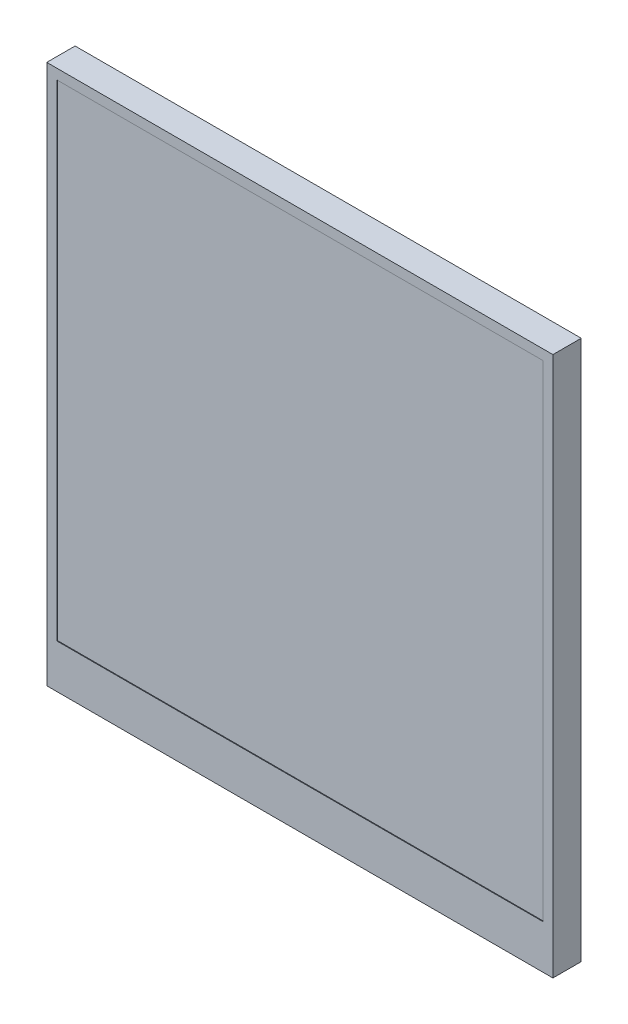
ISO-10303-21;
HEADER;
FILE_DESCRIPTION(('STEP AP214'),'2;1');
FILE_NAME('part.step','',(''),(''),'','','');
FILE_SCHEMA(('AUTOMOTIVE_DESIGN { 1 0 10303 214 1 1 1 1 }'));
ENDSEC;
DATA;
#1=APPLICATION_CONTEXT('core data for automotive mechanical design processes');
#2=APPLICATION_PROTOCOL_DEFINITION('international standard','automotive_design',2000,#1);
#3=PRODUCT_CONTEXT('',#1,'mechanical');
#4=PRODUCT('Part','Part','',(#3));
#5=PRODUCT_RELATED_PRODUCT_CATEGORY('part','',(#4));
#6=PRODUCT_DEFINITION_FORMATION('','',#4);
#7=PRODUCT_DEFINITION_CONTEXT('part definition',#1,'design');
#8=PRODUCT_DEFINITION('design','',#6,#7);
#9=PRODUCT_DEFINITION_SHAPE('','',#8);
#10=(LENGTH_UNIT() NAMED_UNIT(*) SI_UNIT(.MILLI.,.METRE.));
#11=(NAMED_UNIT(*) PLANE_ANGLE_UNIT() SI_UNIT($,.RADIAN.));
#12=(NAMED_UNIT(*) SI_UNIT($,.STERADIAN.) SOLID_ANGLE_UNIT());
#13=UNCERTAINTY_MEASURE_WITH_UNIT(LENGTH_MEASURE(1.E-05),#10,'distance_accuracy_value','');
#14=(GEOMETRIC_REPRESENTATION_CONTEXT(3) GLOBAL_UNCERTAINTY_ASSIGNED_CONTEXT((#13)) GLOBAL_UNIT_ASSIGNED_CONTEXT((#10,
#11,#12)) REPRESENTATION_CONTEXT('',''));
#15=CARTESIAN_POINT('',(0.,0.,0.));
#16=DIRECTION('',(0.,0.,1.));
#17=DIRECTION('',(1.,0.,0.));
#18=AXIS2_PLACEMENT_3D('',#15,#16,#17);
#19=CARTESIAN_POINT('',(0.,0.,4.2));
#20=DIRECTION('',(1.,0.,0.));
#21=DIRECTION('',(0.,0.,-1.));
#22=AXIS2_PLACEMENT_3D('',#19,#20,#21);
#23=PLANE('',#22);
#24=DIRECTION('',(0.,-1.,0.));
#25=VECTOR('',#24,1.);
#26=CARTESIAN_POINT('',(0.,0.,0.));
#27=LINE('',#26,#25);
#28=CARTESIAN_POINT('',(0.,80.,0.));
#29=VERTEX_POINT('',#28);
#30=CARTESIAN_POINT('',(0.,0.,0.));
#31=VERTEX_POINT('',#30);
#32=EDGE_CURVE('E148',#29,#31,#27,.T.);
#33=ORIENTED_EDGE('',*,*,#32,.T.);
#34=DIRECTION('',(0.,0.,-1.));
#35=VECTOR('',#34,1.);
#36=CARTESIAN_POINT('',(0.,0.,4.2));
#37=LINE('',#36,#35);
#38=CARTESIAN_POINT('',(0.,0.,4.2));
#39=VERTEX_POINT('',#38);
#40=EDGE_CURVE('E172',#39,#31,#37,.T.);
#41=ORIENTED_EDGE('',*,*,#40,.F.);
#42=DIRECTION('',(0.,-1.,0.));
#43=VECTOR('',#42,1.);
#44=CARTESIAN_POINT('',(0.,0.,4.2));
#45=LINE('',#44,#43);
#46=CARTESIAN_POINT('',(0.,80.,4.2));
#47=VERTEX_POINT('',#46);
#48=EDGE_CURVE('E152',#47,#39,#45,.T.);
#49=ORIENTED_EDGE('',*,*,#48,.F.);
#50=DIRECTION('',(0.,0.,-1.));
#51=VECTOR('',#50,1.);
#52=CARTESIAN_POINT('',(0.,80.,4.2));
#53=LINE('',#52,#51);
#54=EDGE_CURVE('E158',#47,#29,#53,.T.);
#55=ORIENTED_EDGE('',*,*,#54,.T.);
#56=EDGE_LOOP('',(#33,#41,#49,#55));
#57=FACE_BOUND('',#56,.T.);
#58=ADVANCED_FACE('F35',(#57),#23,.F.);
#59=CARTESIAN_POINT('',(0.,0.,4.2));
#60=DIRECTION('',(0.,1.,0.));
#61=DIRECTION('',(0.,0.,1.));
#62=AXIS2_PLACEMENT_3D('',#59,#60,#61);
#63=PLANE('',#62);
#64=DIRECTION('',(1.,0.,0.));
#65=VECTOR('',#64,1.);
#66=CARTESIAN_POINT('',(0.,0.,0.));
#67=LINE('',#66,#65);
#68=CARTESIAN_POINT('',(75.,0.,0.));
#69=VERTEX_POINT('',#68);
#70=EDGE_CURVE('E161',#31,#69,#67,.T.);
#71=ORIENTED_EDGE('',*,*,#70,.T.);
#72=DIRECTION('',(0.,0.,-1.));
#73=VECTOR('',#72,1.);
#74=CARTESIAN_POINT('',(75.,0.,4.2));
#75=LINE('',#74,#73);
#76=CARTESIAN_POINT('',(75.,0.,4.2));
#77=VERTEX_POINT('',#76);
#78=EDGE_CURVE('E169',#77,#69,#75,.T.);
#79=ORIENTED_EDGE('',*,*,#78,.F.);
#80=DIRECTION('',(1.,0.,0.));
#81=VECTOR('',#80,1.);
#82=CARTESIAN_POINT('',(0.,0.,4.2));
#83=LINE('',#82,#81);
#84=EDGE_CURVE('E87',#39,#77,#83,.T.);
#85=ORIENTED_EDGE('',*,*,#84,.F.);
#86=ORIENTED_EDGE('',*,*,#40,.T.);
#87=EDGE_LOOP('',(#71,#79,#85,#86));
#88=FACE_BOUND('',#87,.T.);
#89=ADVANCED_FACE('F212',(#88),#63,.F.);
#90=CARTESIAN_POINT('',(75.,0.,4.2));
#91=DIRECTION('',(-1.,0.,0.));
#92=DIRECTION('',(0.,0.,1.));
#93=AXIS2_PLACEMENT_3D('',#90,#91,#92);
#94=PLANE('',#93);
#95=DIRECTION('',(0.,1.,0.));
#96=VECTOR('',#95,1.);
#97=CARTESIAN_POINT('',(75.,0.,0.));
#98=LINE('',#97,#96);
#99=CARTESIAN_POINT('',(75.,80.,0.));
#100=VERTEX_POINT('',#99);
#101=EDGE_CURVE('E163',#69,#100,#98,.T.);
#102=ORIENTED_EDGE('',*,*,#101,.T.);
#103=DIRECTION('',(0.,0.,-1.));
#104=VECTOR('',#103,1.);
#105=CARTESIAN_POINT('',(75.,80.,4.2));
#106=LINE('',#105,#104);
#107=CARTESIAN_POINT('',(75.,80.,4.2));
#108=VERTEX_POINT('',#107);
#109=EDGE_CURVE('E167',#108,#100,#106,.T.);
#110=ORIENTED_EDGE('',*,*,#109,.F.);
#111=DIRECTION('',(0.,1.,0.));
#112=VECTOR('',#111,1.);
#113=CARTESIAN_POINT('',(75.,0.,4.2));
#114=LINE('',#113,#112);
#115=EDGE_CURVE('E155',#77,#108,#114,.T.);
#116=ORIENTED_EDGE('',*,*,#115,.F.);
#117=ORIENTED_EDGE('',*,*,#78,.T.);
#118=EDGE_LOOP('',(#102,#110,#116,#117));
#119=FACE_BOUND('',#118,.T.);
#120=ADVANCED_FACE('F217',(#119),#94,.F.);
#121=CARTESIAN_POINT('',(0.,80.,4.2));
#122=DIRECTION('',(0.,-1.,0.));
#123=DIRECTION('',(0.,0.,-1.));
#124=AXIS2_PLACEMENT_3D('',#121,#122,#123);
#125=PLANE('',#124);
#126=DIRECTION('',(-1.,0.,0.));
#127=VECTOR('',#126,1.);
#128=CARTESIAN_POINT('',(0.,80.,0.));
#129=LINE('',#128,#127);
#130=EDGE_CURVE('E79',#100,#29,#129,.T.);
#131=ORIENTED_EDGE('',*,*,#130,.T.);
#132=ORIENTED_EDGE('',*,*,#54,.F.);
#133=DIRECTION('',(-1.,0.,0.));
#134=VECTOR('',#133,1.);
#135=CARTESIAN_POINT('',(0.,80.,4.2));
#136=LINE('',#135,#134);
#137=EDGE_CURVE('E58',#108,#47,#136,.T.);
#138=ORIENTED_EDGE('',*,*,#137,.F.);
#139=ORIENTED_EDGE('',*,*,#109,.T.);
#140=EDGE_LOOP('',(#131,#132,#138,#139));
#141=FACE_BOUND('',#140,.T.);
#142=ADVANCED_FACE('F228',(#141),#125,.F.);
#143=CARTESIAN_POINT('',(0.,0.,4.2));
#144=DIRECTION('',(0.,0.,-1.));
#145=DIRECTION('',(-1.,0.,0.));
#146=AXIS2_PLACEMENT_3D('',#143,#144,#145);
#147=PLANE('',#146);
#148=DIRECTION('',(1.,0.,0.));
#149=VECTOR('',#148,1.);
#150=CARTESIAN_POINT('',(1.50000000000001,6.50000000000001,4.2));
#151=LINE('',#150,#149);
#152=CARTESIAN_POINT('',(1.50000000000001,6.50000000000001,4.2));
#153=VERTEX_POINT('',#152);
#154=CARTESIAN_POINT('',(73.5,6.50000000000001,4.2));
#155=VERTEX_POINT('',#154);
#156=EDGE_CURVE('E141',#153,#155,#151,.T.);
#157=ORIENTED_EDGE('',*,*,#156,.F.);
#158=DIRECTION('',(0.,-1.,0.));
#159=VECTOR('',#158,1.);
#160=CARTESIAN_POINT('',(1.5,78.5,4.2));
#161=LINE('',#160,#159);
#162=CARTESIAN_POINT('',(1.5,78.5,4.2));
#163=VERTEX_POINT('',#162);
#164=EDGE_CURVE('E49',#163,#153,#161,.T.);
#165=ORIENTED_EDGE('',*,*,#164,.F.);
#166=DIRECTION('',(-1.,0.,0.));
#167=VECTOR('',#166,1.);
#168=CARTESIAN_POINT('',(1.5,78.5,4.2));
#169=LINE('',#168,#167);
#170=CARTESIAN_POINT('',(73.5,78.5,4.2));
#171=VERTEX_POINT('',#170);
#172=EDGE_CURVE('E129',#171,#163,#169,.T.);
#173=ORIENTED_EDGE('',*,*,#172,.F.);
#174=DIRECTION('',(0.,1.,0.));
#175=VECTOR('',#174,1.);
#176=CARTESIAN_POINT('',(73.5,78.5,4.2));
#177=LINE('',#176,#175);
#178=EDGE_CURVE('E132',#155,#171,#177,.T.);
#179=ORIENTED_EDGE('',*,*,#178,.F.);
#180=EDGE_LOOP('',(#157,#165,#173,#179));
#181=FACE_BOUND('',#180,.T.);
#182=ORIENTED_EDGE('',*,*,#48,.T.);
#183=ORIENTED_EDGE('',*,*,#84,.T.);
#184=ORIENTED_EDGE('',*,*,#115,.T.);
#185=ORIENTED_EDGE('',*,*,#137,.T.);
#186=EDGE_LOOP('',(#182,#183,#184,#185));
#187=FACE_BOUND('',#186,.T.);
#188=ADVANCED_FACE('F226',(#181,#187),#147,.F.);
#189=CARTESIAN_POINT('',(0.,0.,0.));
#190=DIRECTION('',(0.,0.,-1.));
#191=DIRECTION('',(-1.,0.,0.));
#192=AXIS2_PLACEMENT_3D('',#189,#190,#191);
#193=PLANE('',#192);
#194=CARTESIAN_POINT('',(61.5,75.,0.));
#195=DIRECTION('',(0.,0.,-1.));
#196=DIRECTION('',(-1.,0.,0.));
#197=AXIS2_PLACEMENT_3D('',#194,#195,#196);
#198=CIRCLE('',#197,3.);
#199=CARTESIAN_POINT('',(58.5,75.,0.));
#200=VERTEX_POINT('',#199);
#201=EDGE_CURVE('E292',#200,#200,#198,.T.);
#202=ORIENTED_EDGE('',*,*,#201,.F.);
#203=EDGE_LOOP('',(#202));
#204=FACE_BOUND('',#203,.T.);
#205=CARTESIAN_POINT('',(61.5,26.,0.));
#206=DIRECTION('',(0.,0.,-1.));
#207=DIRECTION('',(-1.,0.,0.));
#208=AXIS2_PLACEMENT_3D('',#205,#206,#207);
#209=CIRCLE('',#208,3.);
#210=CARTESIAN_POINT('',(58.5,26.,0.));
#211=VERTEX_POINT('',#210);
#212=EDGE_CURVE('E303',#211,#211,#209,.T.);
#213=ORIENTED_EDGE('',*,*,#212,.F.);
#214=EDGE_LOOP('',(#213));
#215=FACE_BOUND('',#214,.T.);
#216=CARTESIAN_POINT('',(3.50000000000001,26.,0.));
#217=DIRECTION('',(0.,0.,-1.));
#218=DIRECTION('',(-1.,0.,0.));
#219=AXIS2_PLACEMENT_3D('',#216,#217,#218);
#220=CIRCLE('',#219,3.);
#221=CARTESIAN_POINT('',(0.500000000000013,26.,0.));
#222=VERTEX_POINT('',#221);
#223=EDGE_CURVE('E312',#222,#222,#220,.T.);
#224=ORIENTED_EDGE('',*,*,#223,.F.);
#225=EDGE_LOOP('',(#224));
#226=FACE_BOUND('',#225,.T.);
#227=CARTESIAN_POINT('',(3.5,75.,0.));
#228=DIRECTION('',(0.,0.,-1.));
#229=DIRECTION('',(-1.,0.,0.));
#230=AXIS2_PLACEMENT_3D('',#227,#228,#229);
#231=CIRCLE('',#230,3.);
#232=CARTESIAN_POINT('',(0.500000000000002,75.,0.));
#233=VERTEX_POINT('',#232);
#234=EDGE_CURVE('E135',#233,#233,#231,.T.);
#235=ORIENTED_EDGE('',*,*,#234,.F.);
#236=EDGE_LOOP('',(#235));
#237=FACE_BOUND('',#236,.T.);
#238=ORIENTED_EDGE('',*,*,#32,.F.);
#239=ORIENTED_EDGE('',*,*,#130,.F.);
#240=ORIENTED_EDGE('',*,*,#101,.F.);
#241=ORIENTED_EDGE('',*,*,#70,.F.);
#242=EDGE_LOOP('',(#238,#239,#240,#241));
#243=FACE_BOUND('',#242,.T.);
#244=ADVANCED_FACE('F200',(#204,#215,#226,#237,#243),#193,.T.);
#245=CARTESIAN_POINT('',(1.5,78.5,4.1));
#246=DIRECTION('',(-1.,0.,0.));
#247=DIRECTION('',(0.,-1.,0.));
#248=AXIS2_PLACEMENT_3D('',#245,#246,#247);
#249=PLANE('',#248);
#250=ORIENTED_EDGE('',*,*,#164,.T.);
#251=DIRECTION('',(0.,0.,1.));
#252=VECTOR('',#251,1.);
#253=CARTESIAN_POINT('',(1.50000000000001,6.50000000000001,4.1));
#254=LINE('',#253,#252);
#255=CARTESIAN_POINT('',(1.50000000000001,6.50000000000001,4.1));
#256=VERTEX_POINT('',#255);
#257=EDGE_CURVE('E107',#256,#153,#254,.T.);
#258=ORIENTED_EDGE('',*,*,#257,.F.);
#259=DIRECTION('',(0.,-1.,0.));
#260=VECTOR('',#259,1.);
#261=CARTESIAN_POINT('',(1.5,78.5,4.1));
#262=LINE('',#261,#260);
#263=CARTESIAN_POINT('',(1.5,78.5,4.1));
#264=VERTEX_POINT('',#263);
#265=EDGE_CURVE('E111',#264,#256,#262,.T.);
#266=ORIENTED_EDGE('',*,*,#265,.F.);
#267=DIRECTION('',(0.,0.,1.));
#268=VECTOR('',#267,1.);
#269=CARTESIAN_POINT('',(1.5,78.5,4.1));
#270=LINE('',#269,#268);
#271=EDGE_CURVE('E146',#264,#163,#270,.T.);
#272=ORIENTED_EDGE('',*,*,#271,.T.);
#273=EDGE_LOOP('',(#250,#258,#266,#272));
#274=FACE_BOUND('',#273,.T.);
#275=ADVANCED_FACE('F109',(#274),#249,.F.);
#276=CARTESIAN_POINT('',(1.5,78.5,4.1));
#277=DIRECTION('',(0.,1.,0.));
#278=DIRECTION('',(0.,0.,1.));
#279=AXIS2_PLACEMENT_3D('',#276,#277,#278);
#280=PLANE('',#279);
#281=ORIENTED_EDGE('',*,*,#172,.T.);
#282=ORIENTED_EDGE('',*,*,#271,.F.);
#283=DIRECTION('',(-1.,0.,0.));
#284=VECTOR('',#283,1.);
#285=CARTESIAN_POINT('',(1.5,78.5,4.1));
#286=LINE('',#285,#284);
#287=CARTESIAN_POINT('',(73.5,78.5,4.1));
#288=VERTEX_POINT('',#287);
#289=EDGE_CURVE('E117',#288,#264,#286,.T.);
#290=ORIENTED_EDGE('',*,*,#289,.F.);
#291=DIRECTION('',(0.,0.,1.));
#292=VECTOR('',#291,1.);
#293=CARTESIAN_POINT('',(73.5,78.5,4.1));
#294=LINE('',#293,#292);
#295=EDGE_CURVE('E149',#288,#171,#294,.T.);
#296=ORIENTED_EDGE('',*,*,#295,.T.);
#297=EDGE_LOOP('',(#281,#282,#290,#296));
#298=FACE_BOUND('',#297,.T.);
#299=ADVANCED_FACE('F238',(#298),#280,.F.);
#300=CARTESIAN_POINT('',(73.5,78.5,4.1));
#301=DIRECTION('',(1.,0.,0.));
#302=DIRECTION('',(0.,1.,0.));
#303=AXIS2_PLACEMENT_3D('',#300,#301,#302);
#304=PLANE('',#303);
#305=ORIENTED_EDGE('',*,*,#178,.T.);
#306=ORIENTED_EDGE('',*,*,#295,.F.);
#307=DIRECTION('',(0.,1.,0.));
#308=VECTOR('',#307,1.);
#309=CARTESIAN_POINT('',(73.5,78.5,4.1));
#310=LINE('',#309,#308);
#311=CARTESIAN_POINT('',(73.5,6.50000000000001,4.1));
#312=VERTEX_POINT('',#311);
#313=EDGE_CURVE('E125',#312,#288,#310,.T.);
#314=ORIENTED_EDGE('',*,*,#313,.F.);
#315=DIRECTION('',(0.,0.,1.));
#316=VECTOR('',#315,1.);
#317=CARTESIAN_POINT('',(73.5,6.50000000000001,4.1));
#318=LINE('',#317,#316);
#319=EDGE_CURVE('E116',#312,#155,#318,.T.);
#320=ORIENTED_EDGE('',*,*,#319,.T.);
#321=EDGE_LOOP('',(#305,#306,#314,#320));
#322=FACE_BOUND('',#321,.T.);
#323=ADVANCED_FACE('F241',(#322),#304,.F.);
#324=CARTESIAN_POINT('',(1.50000000000001,6.50000000000001,4.1));
#325=DIRECTION('',(0.,-1.,0.));
#326=DIRECTION('',(1.,0.,0.));
#327=AXIS2_PLACEMENT_3D('',#324,#325,#326);
#328=PLANE('',#327);
#329=ORIENTED_EDGE('',*,*,#156,.T.);
#330=ORIENTED_EDGE('',*,*,#319,.F.);
#331=DIRECTION('',(1.,0.,0.));
#332=VECTOR('',#331,1.);
#333=CARTESIAN_POINT('',(1.50000000000001,6.50000000000001,4.1));
#334=LINE('',#333,#332);
#335=EDGE_CURVE('E120',#256,#312,#334,.T.);
#336=ORIENTED_EDGE('',*,*,#335,.F.);
#337=ORIENTED_EDGE('',*,*,#257,.T.);
#338=EDGE_LOOP('',(#329,#330,#336,#337));
#339=FACE_BOUND('',#338,.T.);
#340=ADVANCED_FACE('F121',(#339),#328,.F.);
#341=CARTESIAN_POINT('',(0.,0.,4.1));
#342=DIRECTION('',(0.,0.,1.));
#343=DIRECTION('',(1.,0.,0.));
#344=AXIS2_PLACEMENT_3D('',#341,#342,#343);
#345=PLANE('',#344);
#346=ORIENTED_EDGE('',*,*,#265,.T.);
#347=ORIENTED_EDGE('',*,*,#335,.T.);
#348=ORIENTED_EDGE('',*,*,#313,.T.);
#349=ORIENTED_EDGE('',*,*,#289,.T.);
#350=EDGE_LOOP('',(#346,#347,#348,#349));
#351=FACE_BOUND('',#350,.T.);
#352=ADVANCED_FACE('F127',(#351),#345,.T.);
#353=CARTESIAN_POINT('',(3.5,75.,-2.));
#354=DIRECTION('',(0.,0.,-1.));
#355=DIRECTION('',(-1.,0.,0.));
#356=AXIS2_PLACEMENT_3D('',#353,#354,#355);
#357=PLANE('',#356);
#358=CARTESIAN_POINT('',(3.5,75.,-2.));
#359=DIRECTION('',(0.,0.,-1.));
#360=DIRECTION('',(-1.,0.,0.));
#361=AXIS2_PLACEMENT_3D('',#358,#359,#360);
#362=CIRCLE('',#361,3.);
#363=CARTESIAN_POINT('',(0.500000000000002,75.,-2.));
#364=VERTEX_POINT('',#363);
#365=EDGE_CURVE('E142',#364,#364,#362,.T.);
#366=ORIENTED_EDGE('',*,*,#365,.T.);
#367=EDGE_LOOP('',(#366));
#368=FACE_BOUND('',#367,.T.);
#369=CARTESIAN_POINT('',(3.5,75.,-2.));
#370=DIRECTION('',(0.,0.,-1.));
#371=DIRECTION('',(-1.,0.,0.));
#372=AXIS2_PLACEMENT_3D('',#369,#370,#371);
#373=CIRCLE('',#372,1.35);
#374=CARTESIAN_POINT('',(2.15,75.,-2.));
#375=VERTEX_POINT('',#374);
#376=EDGE_CURVE('E316',#375,#375,#373,.T.);
#377=ORIENTED_EDGE('',*,*,#376,.F.);
#378=EDGE_LOOP('',(#377));
#379=FACE_BOUND('',#378,.T.);
#380=ADVANCED_FACE('F250',(#368,#379),#357,.T.);
#381=CARTESIAN_POINT('',(3.5,75.,-2.));
#382=DIRECTION('',(0.,0.,1.));
#383=DIRECTION('',(1.,0.,0.));
#384=AXIS2_PLACEMENT_3D('',#381,#382,#383);
#385=CYLINDRICAL_SURFACE('',#384,3.);
#386=ORIENTED_EDGE('',*,*,#365,.F.);
#387=EDGE_LOOP('',(#386));
#388=FACE_BOUND('',#387,.T.);
#389=ORIENTED_EDGE('',*,*,#234,.T.);
#390=EDGE_LOOP('',(#389));
#391=FACE_BOUND('',#390,.T.);
#392=ADVANCED_FACE('F251',(#388,#391),#385,.T.);
#393=CARTESIAN_POINT('',(3.5,75.,-2.));
#394=DIRECTION('',(0.,0.,1.));
#395=DIRECTION('',(1.,0.,0.));
#396=AXIS2_PLACEMENT_3D('',#393,#394,#395);
#397=CYLINDRICAL_SURFACE('',#396,1.35);
#398=ORIENTED_EDGE('',*,*,#376,.T.);
#399=EDGE_LOOP('',(#398));
#400=FACE_BOUND('',#399,.T.);
#401=CARTESIAN_POINT('',(3.5,75.,0.));
#402=DIRECTION('',(0.,0.,-1.));
#403=DIRECTION('',(-1.,0.,0.));
#404=AXIS2_PLACEMENT_3D('',#401,#402,#403);
#405=CIRCLE('',#404,1.35);
#406=CARTESIAN_POINT('',(2.15,75.,0.));
#407=VERTEX_POINT('',#406);
#408=EDGE_CURVE('E174',#407,#407,#405,.F.);
#409=ORIENTED_EDGE('',*,*,#408,.T.);
#410=EDGE_LOOP('',(#409));
#411=FACE_BOUND('',#410,.T.);
#412=ADVANCED_FACE('F254',(#400,#411),#397,.F.);
#413=ORIENTED_EDGE('',*,*,#408,.F.);
#414=EDGE_LOOP('',(#413));
#415=FACE_BOUND('',#414,.T.);
#416=ADVANCED_FACE('F207',(#415),#193,.T.);
#417=CARTESIAN_POINT('',(3.50000000000001,26.,-2.));
#418=DIRECTION('',(0.,0.,-1.));
#419=DIRECTION('',(-1.,0.,0.));
#420=AXIS2_PLACEMENT_3D('',#417,#418,#419);
#421=PLANE('',#420);
#422=CARTESIAN_POINT('',(3.50000000000001,26.,-2.));
#423=DIRECTION('',(0.,0.,-1.));
#424=DIRECTION('',(-1.,0.,0.));
#425=AXIS2_PLACEMENT_3D('',#422,#423,#424);
#426=CIRCLE('',#425,3.);
#427=CARTESIAN_POINT('',(0.500000000000013,26.,-2.));
#428=VERTEX_POINT('',#427);
#429=EDGE_CURVE('E313',#428,#428,#426,.T.);
#430=ORIENTED_EDGE('',*,*,#429,.T.);
#431=EDGE_LOOP('',(#430));
#432=FACE_BOUND('',#431,.T.);
#433=CARTESIAN_POINT('',(3.50000000000001,26.,-2.));
#434=DIRECTION('',(0.,0.,-1.));
#435=DIRECTION('',(-1.,0.,0.));
#436=AXIS2_PLACEMENT_3D('',#433,#434,#435);
#437=CIRCLE('',#436,1.35);
#438=CARTESIAN_POINT('',(2.15000000000001,26.,-2.));
#439=VERTEX_POINT('',#438);
#440=EDGE_CURVE('E307',#439,#439,#437,.T.);
#441=ORIENTED_EDGE('',*,*,#440,.F.);
#442=EDGE_LOOP('',(#441));
#443=FACE_BOUND('',#442,.T.);
#444=ADVANCED_FACE('F265',(#432,#443),#421,.T.);
#445=CARTESIAN_POINT('',(3.50000000000001,26.,-2.));
#446=DIRECTION('',(0.,0.,1.));
#447=DIRECTION('',(1.,0.,0.));
#448=AXIS2_PLACEMENT_3D('',#445,#446,#447);
#449=CYLINDRICAL_SURFACE('',#448,3.);
#450=ORIENTED_EDGE('',*,*,#429,.F.);
#451=EDGE_LOOP('',(#450));
#452=FACE_BOUND('',#451,.T.);
#453=ORIENTED_EDGE('',*,*,#223,.T.);
#454=EDGE_LOOP('',(#453));
#455=FACE_BOUND('',#454,.T.);
#456=ADVANCED_FACE('F262',(#452,#455),#449,.T.);
#457=CARTESIAN_POINT('',(3.50000000000001,26.,-2.));
#458=DIRECTION('',(0.,0.,1.));
#459=DIRECTION('',(1.,0.,0.));
#460=AXIS2_PLACEMENT_3D('',#457,#458,#459);
#461=CYLINDRICAL_SURFACE('',#460,1.35);
#462=ORIENTED_EDGE('',*,*,#440,.T.);
#463=EDGE_LOOP('',(#462));
#464=FACE_BOUND('',#463,.T.);
#465=CARTESIAN_POINT('',(3.50000000000001,26.,0.));
#466=DIRECTION('',(0.,0.,-1.));
#467=DIRECTION('',(-1.,0.,0.));
#468=AXIS2_PLACEMENT_3D('',#465,#466,#467);
#469=CIRCLE('',#468,1.35);
#470=CARTESIAN_POINT('',(2.15000000000001,26.,0.));
#471=VERTEX_POINT('',#470);
#472=EDGE_CURVE('E177',#471,#471,#469,.F.);
#473=ORIENTED_EDGE('',*,*,#472,.T.);
#474=EDGE_LOOP('',(#473));
#475=FACE_BOUND('',#474,.T.);
#476=ADVANCED_FACE('F205',(#464,#475),#461,.F.);
#477=ORIENTED_EDGE('',*,*,#472,.F.);
#478=EDGE_LOOP('',(#477));
#479=FACE_BOUND('',#478,.T.);
#480=ADVANCED_FACE('F188',(#479),#193,.T.);
#481=CARTESIAN_POINT('',(61.5,26.,-2.));
#482=DIRECTION('',(0.,0.,-1.));
#483=DIRECTION('',(-1.,0.,0.));
#484=AXIS2_PLACEMENT_3D('',#481,#482,#483);
#485=PLANE('',#484);
#486=CARTESIAN_POINT('',(61.5,26.,-2.));
#487=DIRECTION('',(0.,0.,-1.));
#488=DIRECTION('',(-1.,0.,0.));
#489=AXIS2_PLACEMENT_3D('',#486,#487,#488);
#490=CIRCLE('',#489,3.);
#491=CARTESIAN_POINT('',(58.5,26.,-2.));
#492=VERTEX_POINT('',#491);
#493=EDGE_CURVE('E304',#492,#492,#490,.T.);
#494=ORIENTED_EDGE('',*,*,#493,.T.);
#495=EDGE_LOOP('',(#494));
#496=FACE_BOUND('',#495,.T.);
#497=CARTESIAN_POINT('',(61.5,26.,-2.));
#498=DIRECTION('',(0.,0.,-1.));
#499=DIRECTION('',(-1.,0.,0.));
#500=AXIS2_PLACEMENT_3D('',#497,#498,#499);
#501=CIRCLE('',#500,1.35);
#502=CARTESIAN_POINT('',(60.15,26.,-2.));
#503=VERTEX_POINT('',#502);
#504=EDGE_CURVE('E299',#503,#503,#501,.T.);
#505=ORIENTED_EDGE('',*,*,#504,.F.);
#506=EDGE_LOOP('',(#505));
#507=FACE_BOUND('',#506,.T.);
#508=ADVANCED_FACE('F204',(#496,#507),#485,.T.);
#509=CARTESIAN_POINT('',(61.5,26.,-2.));
#510=DIRECTION('',(0.,0.,1.));
#511=DIRECTION('',(1.,0.,0.));
#512=AXIS2_PLACEMENT_3D('',#509,#510,#511);
#513=CYLINDRICAL_SURFACE('',#512,3.);
#514=ORIENTED_EDGE('',*,*,#493,.F.);
#515=EDGE_LOOP('',(#514));
#516=FACE_BOUND('',#515,.T.);
#517=ORIENTED_EDGE('',*,*,#212,.T.);
#518=EDGE_LOOP('',(#517));
#519=FACE_BOUND('',#518,.T.);
#520=ADVANCED_FACE('F197',(#516,#519),#513,.T.);
#521=CARTESIAN_POINT('',(61.5,26.,-2.));
#522=DIRECTION('',(0.,0.,1.));
#523=DIRECTION('',(1.,0.,0.));
#524=AXIS2_PLACEMENT_3D('',#521,#522,#523);
#525=CYLINDRICAL_SURFACE('',#524,1.35);
#526=ORIENTED_EDGE('',*,*,#504,.T.);
#527=EDGE_LOOP('',(#526));
#528=FACE_BOUND('',#527,.T.);
#529=CARTESIAN_POINT('',(61.5,26.,0.));
#530=DIRECTION('',(0.,0.,-1.));
#531=DIRECTION('',(-1.,0.,0.));
#532=AXIS2_PLACEMENT_3D('',#529,#530,#531);
#533=CIRCLE('',#532,1.35);
#534=CARTESIAN_POINT('',(60.15,26.,0.));
#535=VERTEX_POINT('',#534);
#536=EDGE_CURVE('E42',#535,#535,#533,.F.);
#537=ORIENTED_EDGE('',*,*,#536,.T.);
#538=EDGE_LOOP('',(#537));
#539=FACE_BOUND('',#538,.T.);
#540=ADVANCED_FACE('F182',(#528,#539),#525,.F.);
#541=ORIENTED_EDGE('',*,*,#536,.F.);
#542=EDGE_LOOP('',(#541));
#543=FACE_BOUND('',#542,.T.);
#544=ADVANCED_FACE('F184',(#543),#193,.T.);
#545=CARTESIAN_POINT('',(61.5,75.,-2.));
#546=DIRECTION('',(0.,0.,-1.));
#547=DIRECTION('',(-1.,0.,0.));
#548=AXIS2_PLACEMENT_3D('',#545,#546,#547);
#549=PLANE('',#548);
#550=CARTESIAN_POINT('',(61.5,75.,-2.));
#551=DIRECTION('',(0.,0.,-1.));
#552=DIRECTION('',(-1.,0.,0.));
#553=AXIS2_PLACEMENT_3D('',#550,#551,#552);
#554=CIRCLE('',#553,3.);
#555=CARTESIAN_POINT('',(58.5,75.,-2.));
#556=VERTEX_POINT('',#555);
#557=EDGE_CURVE('E295',#556,#556,#554,.T.);
#558=ORIENTED_EDGE('',*,*,#557,.T.);
#559=EDGE_LOOP('',(#558));
#560=FACE_BOUND('',#559,.T.);
#561=CARTESIAN_POINT('',(61.5,75.,-2.));
#562=DIRECTION('',(0.,0.,-1.));
#563=DIRECTION('',(-1.,0.,0.));
#564=AXIS2_PLACEMENT_3D('',#561,#562,#563);
#565=CIRCLE('',#564,1.35);
#566=CARTESIAN_POINT('',(60.15,75.,-2.));
#567=VERTEX_POINT('',#566);
#568=EDGE_CURVE('E289',#567,#567,#565,.T.);
#569=ORIENTED_EDGE('',*,*,#568,.F.);
#570=EDGE_LOOP('',(#569));
#571=FACE_BOUND('',#570,.T.);
#572=ADVANCED_FACE('F186',(#560,#571),#549,.T.);
#573=CARTESIAN_POINT('',(61.5,75.,-2.));
#574=DIRECTION('',(0.,0.,1.));
#575=DIRECTION('',(1.,0.,0.));
#576=AXIS2_PLACEMENT_3D('',#573,#574,#575);
#577=CYLINDRICAL_SURFACE('',#576,3.);
#578=ORIENTED_EDGE('',*,*,#557,.F.);
#579=EDGE_LOOP('',(#578));
#580=FACE_BOUND('',#579,.T.);
#581=ORIENTED_EDGE('',*,*,#201,.T.);
#582=EDGE_LOOP('',(#581));
#583=FACE_BOUND('',#582,.T.);
#584=ADVANCED_FACE('F194',(#580,#583),#577,.T.);
#585=CARTESIAN_POINT('',(61.5,75.,-2.));
#586=DIRECTION('',(0.,0.,1.));
#587=DIRECTION('',(1.,0.,0.));
#588=AXIS2_PLACEMENT_3D('',#585,#586,#587);
#589=CYLINDRICAL_SURFACE('',#588,1.35);
#590=ORIENTED_EDGE('',*,*,#568,.T.);
#591=EDGE_LOOP('',(#590));
#592=FACE_BOUND('',#591,.T.);
#593=CARTESIAN_POINT('',(61.5,75.,0.));
#594=DIRECTION('',(0.,0.,-1.));
#595=DIRECTION('',(-1.,0.,0.));
#596=AXIS2_PLACEMENT_3D('',#593,#594,#595);
#597=CIRCLE('',#596,1.35);
#598=CARTESIAN_POINT('',(60.15,75.,0.));
#599=VERTEX_POINT('',#598);
#600=EDGE_CURVE('E11',#599,#599,#597,.F.);
#601=ORIENTED_EDGE('',*,*,#600,.T.);
#602=EDGE_LOOP('',(#601));
#603=FACE_BOUND('',#602,.T.);
#604=ADVANCED_FACE('F209',(#592,#603),#589,.F.);
#605=ORIENTED_EDGE('',*,*,#600,.F.);
#606=EDGE_LOOP('',(#605));
#607=FACE_BOUND('',#606,.T.);
#608=ADVANCED_FACE('F189',(#607),#193,.T.);
#609=CLOSED_SHELL('',(#58,#89,#120,#142,#188,#244,#275,#299,#323,#340,#352,#380,#392,#412,#416,
#444,#456,#476,#480,#508,#520,#540,#544,#572,#584,#604,#608));
#610=MANIFOLD_SOLID_BREP('B2',#609);
#611=ADVANCED_BREP_SHAPE_REPRESENTATION('',(#18,#610),#14);
#612=SHAPE_DEFINITION_REPRESENTATION(#9,#611);
ENDSEC;
END-ISO-10303-21;
